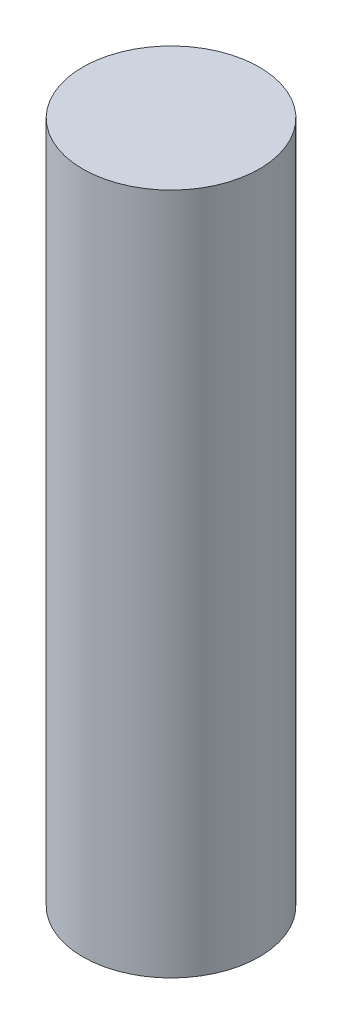
ISO-10303-21;
HEADER;
FILE_DESCRIPTION(('STEP AP214'),'2;1');
FILE_NAME('part.step','',(''),(''),'','','');
FILE_SCHEMA(('AUTOMOTIVE_DESIGN { 1 0 10303 214 1 1 1 1 }'));
ENDSEC;
DATA;
#1=APPLICATION_CONTEXT('core data for automotive mechanical design processes');
#2=APPLICATION_PROTOCOL_DEFINITION('international standard','automotive_design',2000,#1);
#3=PRODUCT_CONTEXT('',#1,'mechanical');
#4=PRODUCT('Part','Part','',(#3));
#5=PRODUCT_RELATED_PRODUCT_CATEGORY('part','',(#4));
#6=PRODUCT_DEFINITION_FORMATION('','',#4);
#7=PRODUCT_DEFINITION_CONTEXT('part definition',#1,'design');
#8=PRODUCT_DEFINITION('design','',#6,#7);
#9=PRODUCT_DEFINITION_SHAPE('','',#8);
#10=(LENGTH_UNIT() NAMED_UNIT(*) SI_UNIT(.MILLI.,.METRE.));
#11=(NAMED_UNIT(*) PLANE_ANGLE_UNIT() SI_UNIT($,.RADIAN.));
#12=(NAMED_UNIT(*) SI_UNIT($,.STERADIAN.) SOLID_ANGLE_UNIT());
#13=UNCERTAINTY_MEASURE_WITH_UNIT(LENGTH_MEASURE(1.E-05),#10,'distance_accuracy_value','');
#14=(GEOMETRIC_REPRESENTATION_CONTEXT(3) GLOBAL_UNCERTAINTY_ASSIGNED_CONTEXT((#13)) GLOBAL_UNIT_ASSIGNED_CONTEXT((#10,
#11,#12)) REPRESENTATION_CONTEXT('',''));
#15=CARTESIAN_POINT('',(0.,0.,0.));
#16=DIRECTION('',(0.,0.,1.));
#17=DIRECTION('',(1.,0.,0.));
#18=AXIS2_PLACEMENT_3D('',#15,#16,#17);
#19=CARTESIAN_POINT('',(0.,85.,0.));
#20=DIRECTION('',(0.,-1.,0.));
#21=DIRECTION('',(0.,0.,-1.));
#22=AXIS2_PLACEMENT_3D('',#19,#20,#21);
#23=CYLINDRICAL_SURFACE('',#22,11.);
#24=CARTESIAN_POINT('',(0.,85.,0.));
#25=DIRECTION('',(0.,1.,0.));
#26=DIRECTION('',(0.,0.,1.));
#27=AXIS2_PLACEMENT_3D('',#24,#25,#26);
#28=CIRCLE('',#27,11.);
#29=CARTESIAN_POINT('',(0.,85.,11.));
#30=VERTEX_POINT('',#29);
#31=EDGE_CURVE('E10',#30,#30,#28,.T.);
#32=ORIENTED_EDGE('',*,*,#31,.F.);
#33=EDGE_LOOP('',(#32));
#34=FACE_BOUND('',#33,.T.);
#35=CARTESIAN_POINT('',(0.,0.,0.));
#36=DIRECTION('',(0.,1.,0.));
#37=DIRECTION('',(0.,0.,1.));
#38=AXIS2_PLACEMENT_3D('',#35,#36,#37);
#39=CIRCLE('',#38,11.);
#40=CARTESIAN_POINT('',(0.,0.,11.));
#41=VERTEX_POINT('',#40);
#42=EDGE_CURVE('E36',#41,#41,#39,.T.);
#43=ORIENTED_EDGE('',*,*,#42,.T.);
#44=EDGE_LOOP('',(#43));
#45=FACE_BOUND('',#44,.T.);
#46=ADVANCED_FACE('F33',(#34,#45),#23,.T.);
#47=CARTESIAN_POINT('',(0.,85.,0.));
#48=DIRECTION('',(0.,1.,0.));
#49=DIRECTION('',(0.,0.,1.));
#50=AXIS2_PLACEMENT_3D('',#47,#48,#49);
#51=PLANE('',#50);
#52=ORIENTED_EDGE('',*,*,#31,.T.);
#53=EDGE_LOOP('',(#52));
#54=FACE_BOUND('',#53,.T.);
#55=ADVANCED_FACE('F48',(#54),#51,.T.);
#56=CARTESIAN_POINT('',(0.,0.,0.));
#57=DIRECTION('',(0.,1.,0.));
#58=DIRECTION('',(0.,0.,1.));
#59=AXIS2_PLACEMENT_3D('',#56,#57,#58);
#60=PLANE('',#59);
#61=ORIENTED_EDGE('',*,*,#42,.F.);
#62=EDGE_LOOP('',(#61));
#63=FACE_BOUND('',#62,.T.);
#64=ADVANCED_FACE('F46',(#63),#60,.F.);
#65=CLOSED_SHELL('',(#46,#55,#64));
#66=MANIFOLD_SOLID_BREP('B2',#65);
#67=ADVANCED_BREP_SHAPE_REPRESENTATION('',(#18,#66),#14);
#68=SHAPE_DEFINITION_REPRESENTATION(#9,#67);
ENDSEC;
END-ISO-10303-21;
